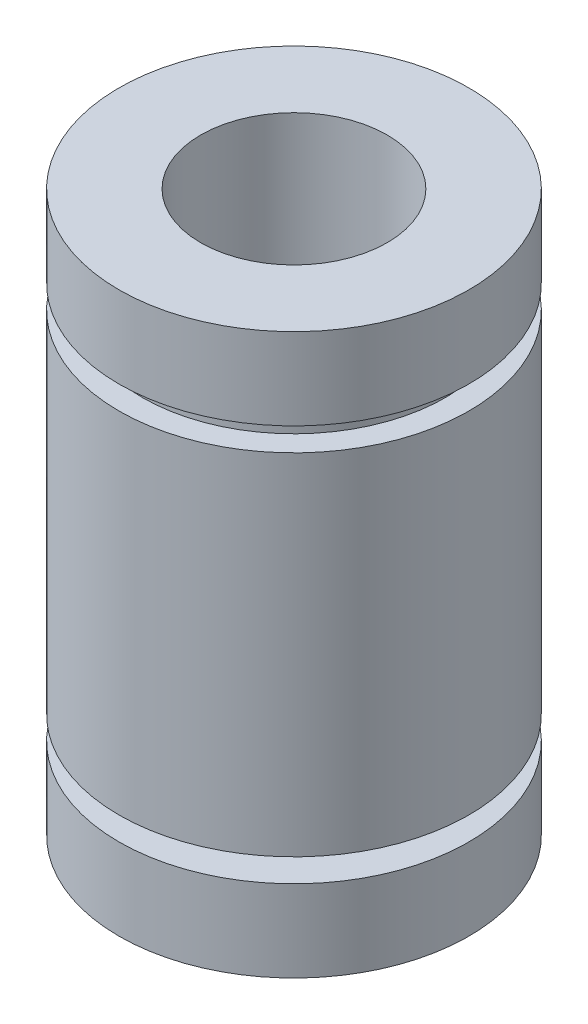
ISO-10303-21;
HEADER;
FILE_DESCRIPTION(('STEP AP214'),'2;1');
FILE_NAME('part.step','',(''),(''),'','','');
FILE_SCHEMA(('AUTOMOTIVE_DESIGN { 1 0 10303 214 1 1 1 1 }'));
ENDSEC;
DATA;
#1=APPLICATION_CONTEXT('core data for automotive mechanical design processes');
#2=APPLICATION_PROTOCOL_DEFINITION('international standard','automotive_design',2000,#1);
#3=PRODUCT_CONTEXT('',#1,'mechanical');
#4=PRODUCT('Part','Part','',(#3));
#5=PRODUCT_RELATED_PRODUCT_CATEGORY('part','',(#4));
#6=PRODUCT_DEFINITION_FORMATION('','',#4);
#7=PRODUCT_DEFINITION_CONTEXT('part definition',#1,'design');
#8=PRODUCT_DEFINITION('design','',#6,#7);
#9=PRODUCT_DEFINITION_SHAPE('','',#8);
#10=(LENGTH_UNIT() NAMED_UNIT(*) SI_UNIT(.MILLI.,.METRE.));
#11=(NAMED_UNIT(*) PLANE_ANGLE_UNIT() SI_UNIT($,.RADIAN.));
#12=(NAMED_UNIT(*) SI_UNIT($,.STERADIAN.) SOLID_ANGLE_UNIT());
#13=UNCERTAINTY_MEASURE_WITH_UNIT(LENGTH_MEASURE(1.E-05),#10,'distance_accuracy_value','');
#14=(GEOMETRIC_REPRESENTATION_CONTEXT(3) GLOBAL_UNCERTAINTY_ASSIGNED_CONTEXT((#13)) GLOBAL_UNIT_ASSIGNED_CONTEXT((#10,
#11,#12)) REPRESENTATION_CONTEXT('',''));
#15=CARTESIAN_POINT('',(0.,0.,0.));
#16=DIRECTION('',(0.,0.,1.));
#17=DIRECTION('',(1.,0.,0.));
#18=AXIS2_PLACEMENT_3D('',#15,#16,#17);
#19=CARTESIAN_POINT('',(0.,0.,0.));
#20=DIRECTION('',(0.,1.,0.));
#21=DIRECTION('',(0.,0.,1.));
#22=AXIS2_PLACEMENT_3D('',#19,#20,#21);
#23=CYLINDRICAL_SURFACE('',#22,7.5);
#24=CARTESIAN_POINT('',(0.,-3.5,0.));
#25=DIRECTION('',(0.,1.,0.));
#26=DIRECTION('',(0.,0.,1.));
#27=AXIS2_PLACEMENT_3D('',#24,#25,#26);
#28=CIRCLE('',#27,7.5);
#29=CARTESIAN_POINT('',(0.,-3.5,7.5));
#30=VERTEX_POINT('',#29);
#31=EDGE_CURVE('E10',#30,#30,#28,.T.);
#32=ORIENTED_EDGE('',*,*,#31,.T.);
#33=EDGE_LOOP('',(#32));
#34=FACE_BOUND('',#33,.T.);
#35=CARTESIAN_POINT('',(0.,0.,0.));
#36=DIRECTION('',(0.,1.,0.));
#37=DIRECTION('',(0.,0.,1.));
#38=AXIS2_PLACEMENT_3D('',#35,#36,#37);
#39=CIRCLE('',#38,7.5);
#40=CARTESIAN_POINT('',(0.,0.,7.5));
#41=VERTEX_POINT('',#40);
#42=EDGE_CURVE('E72',#41,#41,#39,.T.);
#43=ORIENTED_EDGE('',*,*,#42,.F.);
#44=EDGE_LOOP('',(#43));
#45=FACE_BOUND('',#44,.T.);
#46=ADVANCED_FACE('F32',(#34,#45),#23,.T.);
#47=CARTESIAN_POINT('',(0.,-3.5,7.5));
#48=DIRECTION('',(0.,-1.,0.));
#49=DIRECTION('',(0.,0.,-1.));
#50=AXIS2_PLACEMENT_3D('',#47,#48,#49);
#51=PLANE('',#50);
#52=CARTESIAN_POINT('',(0.,-3.5,0.));
#53=DIRECTION('',(0.,1.,0.));
#54=DIRECTION('',(0.,0.,1.));
#55=AXIS2_PLACEMENT_3D('',#52,#53,#54);
#56=CIRCLE('',#55,6.5);
#57=CARTESIAN_POINT('',(0.,-3.5,6.5));
#58=VERTEX_POINT('',#57);
#59=EDGE_CURVE('E38',#58,#58,#56,.T.);
#60=ORIENTED_EDGE('',*,*,#59,.T.);
#61=EDGE_LOOP('',(#60));
#62=FACE_BOUND('',#61,.T.);
#63=ORIENTED_EDGE('',*,*,#31,.F.);
#64=EDGE_LOOP('',(#63));
#65=FACE_BOUND('',#64,.T.);
#66=ADVANCED_FACE('F80',(#62,#65),#51,.T.);
#67=CARTESIAN_POINT('',(0.,0.,0.));
#68=DIRECTION('',(0.,1.,0.));
#69=DIRECTION('',(0.,0.,1.));
#70=AXIS2_PLACEMENT_3D('',#67,#68,#69);
#71=CYLINDRICAL_SURFACE('',#70,6.5);
#72=CARTESIAN_POINT('',(0.,-4.5,0.));
#73=DIRECTION('',(0.,1.,0.));
#74=DIRECTION('',(0.,0.,1.));
#75=AXIS2_PLACEMENT_3D('',#72,#73,#74);
#76=CIRCLE('',#75,6.5);
#77=CARTESIAN_POINT('',(0.,-4.5,6.5));
#78=VERTEX_POINT('',#77);
#79=EDGE_CURVE('E42',#78,#78,#76,.T.);
#80=ORIENTED_EDGE('',*,*,#79,.T.);
#81=EDGE_LOOP('',(#80));
#82=FACE_BOUND('',#81,.T.);
#83=ORIENTED_EDGE('',*,*,#59,.F.);
#84=EDGE_LOOP('',(#83));
#85=FACE_BOUND('',#84,.T.);
#86=ADVANCED_FACE('F84',(#82,#85),#71,.T.);
#87=CARTESIAN_POINT('',(0.,-4.5,6.5));
#88=DIRECTION('',(0.,1.,0.));
#89=DIRECTION('',(0.,0.,1.));
#90=AXIS2_PLACEMENT_3D('',#87,#88,#89);
#91=PLANE('',#90);
#92=CARTESIAN_POINT('',(0.,-4.5,0.));
#93=DIRECTION('',(0.,1.,0.));
#94=DIRECTION('',(0.,0.,1.));
#95=AXIS2_PLACEMENT_3D('',#92,#93,#94);
#96=CIRCLE('',#95,7.5);
#97=CARTESIAN_POINT('',(0.,-4.5,7.5));
#98=VERTEX_POINT('',#97);
#99=EDGE_CURVE('E46',#98,#98,#96,.T.);
#100=ORIENTED_EDGE('',*,*,#99,.T.);
#101=EDGE_LOOP('',(#100));
#102=FACE_BOUND('',#101,.T.);
#103=ORIENTED_EDGE('',*,*,#79,.F.);
#104=EDGE_LOOP('',(#103));
#105=FACE_BOUND('',#104,.T.);
#106=ADVANCED_FACE('F88',(#102,#105),#91,.T.);
#107=CARTESIAN_POINT('',(0.,0.,0.));
#108=DIRECTION('',(0.,1.,0.));
#109=DIRECTION('',(0.,0.,1.));
#110=AXIS2_PLACEMENT_3D('',#107,#108,#109);
#111=CYLINDRICAL_SURFACE('',#110,7.5);
#112=CARTESIAN_POINT('',(0.,-19.5,0.));
#113=DIRECTION('',(0.,1.,0.));
#114=DIRECTION('',(0.,0.,1.));
#115=AXIS2_PLACEMENT_3D('',#112,#113,#114);
#116=CIRCLE('',#115,7.5);
#117=CARTESIAN_POINT('',(0.,-19.5,7.5));
#118=VERTEX_POINT('',#117);
#119=EDGE_CURVE('E51',#118,#118,#116,.T.);
#120=ORIENTED_EDGE('',*,*,#119,.T.);
#121=EDGE_LOOP('',(#120));
#122=FACE_BOUND('',#121,.T.);
#123=ORIENTED_EDGE('',*,*,#99,.F.);
#124=EDGE_LOOP('',(#123));
#125=FACE_BOUND('',#124,.T.);
#126=ADVANCED_FACE('F95',(#122,#125),#111,.T.);
#127=CARTESIAN_POINT('',(0.,-19.5,7.5));
#128=DIRECTION('',(0.,-1.,0.));
#129=DIRECTION('',(0.,0.,-1.));
#130=AXIS2_PLACEMENT_3D('',#127,#128,#129);
#131=PLANE('',#130);
#132=CARTESIAN_POINT('',(0.,-19.5,0.));
#133=DIRECTION('',(0.,1.,0.));
#134=DIRECTION('',(0.,0.,1.));
#135=AXIS2_PLACEMENT_3D('',#132,#133,#134);
#136=CIRCLE('',#135,5.75);
#137=CARTESIAN_POINT('',(0.,-19.5,5.75));
#138=VERTEX_POINT('',#137);
#139=EDGE_CURVE('E54',#138,#138,#136,.T.);
#140=ORIENTED_EDGE('',*,*,#139,.T.);
#141=EDGE_LOOP('',(#140));
#142=FACE_BOUND('',#141,.T.);
#143=ORIENTED_EDGE('',*,*,#119,.F.);
#144=EDGE_LOOP('',(#143));
#145=FACE_BOUND('',#144,.T.);
#146=ADVANCED_FACE('F99',(#142,#145),#131,.T.);
#147=CARTESIAN_POINT('',(0.,0.,0.));
#148=DIRECTION('',(0.,1.,0.));
#149=DIRECTION('',(0.,0.,1.));
#150=AXIS2_PLACEMENT_3D('',#147,#148,#149);
#151=CYLINDRICAL_SURFACE('',#150,5.75);
#152=CARTESIAN_POINT('',(0.,-20.5,0.));
#153=DIRECTION('',(0.,1.,0.));
#154=DIRECTION('',(0.,0.,1.));
#155=AXIS2_PLACEMENT_3D('',#152,#153,#154);
#156=CIRCLE('',#155,5.75);
#157=CARTESIAN_POINT('',(0.,-20.5,5.75));
#158=VERTEX_POINT('',#157);
#159=EDGE_CURVE('E57',#158,#158,#156,.T.);
#160=ORIENTED_EDGE('',*,*,#159,.T.);
#161=EDGE_LOOP('',(#160));
#162=FACE_BOUND('',#161,.T.);
#163=ORIENTED_EDGE('',*,*,#139,.F.);
#164=EDGE_LOOP('',(#163));
#165=FACE_BOUND('',#164,.T.);
#166=ADVANCED_FACE('F103',(#162,#165),#151,.T.);
#167=CARTESIAN_POINT('',(0.,-20.5,5.75));
#168=DIRECTION('',(0.,1.,0.));
#169=DIRECTION('',(0.,0.,1.));
#170=AXIS2_PLACEMENT_3D('',#167,#168,#169);
#171=PLANE('',#170);
#172=CARTESIAN_POINT('',(0.,-20.5,0.));
#173=DIRECTION('',(0.,1.,0.));
#174=DIRECTION('',(0.,0.,1.));
#175=AXIS2_PLACEMENT_3D('',#172,#173,#174);
#176=CIRCLE('',#175,7.5);
#177=CARTESIAN_POINT('',(0.,-20.5,7.5));
#178=VERTEX_POINT('',#177);
#179=EDGE_CURVE('E60',#178,#178,#176,.T.);
#180=ORIENTED_EDGE('',*,*,#179,.T.);
#181=EDGE_LOOP('',(#180));
#182=FACE_BOUND('',#181,.T.);
#183=ORIENTED_EDGE('',*,*,#159,.F.);
#184=EDGE_LOOP('',(#183));
#185=FACE_BOUND('',#184,.T.);
#186=ADVANCED_FACE('F107',(#182,#185),#171,.T.);
#187=CARTESIAN_POINT('',(0.,0.,0.));
#188=DIRECTION('',(0.,1.,0.));
#189=DIRECTION('',(0.,0.,1.));
#190=AXIS2_PLACEMENT_3D('',#187,#188,#189);
#191=CYLINDRICAL_SURFACE('',#190,7.5);
#192=CARTESIAN_POINT('',(0.,-24.,0.));
#193=DIRECTION('',(0.,1.,0.));
#194=DIRECTION('',(0.,0.,1.));
#195=AXIS2_PLACEMENT_3D('',#192,#193,#194);
#196=CIRCLE('',#195,7.5);
#197=CARTESIAN_POINT('',(0.,-24.,7.5));
#198=VERTEX_POINT('',#197);
#199=EDGE_CURVE('E63',#198,#198,#196,.T.);
#200=ORIENTED_EDGE('',*,*,#199,.T.);
#201=EDGE_LOOP('',(#200));
#202=FACE_BOUND('',#201,.T.);
#203=ORIENTED_EDGE('',*,*,#179,.F.);
#204=EDGE_LOOP('',(#203));
#205=FACE_BOUND('',#204,.T.);
#206=ADVANCED_FACE('F111',(#202,#205),#191,.T.);
#207=CARTESIAN_POINT('',(0.,-24.,7.5));
#208=DIRECTION('',(0.,-1.,0.));
#209=DIRECTION('',(0.,0.,-1.));
#210=AXIS2_PLACEMENT_3D('',#207,#208,#209);
#211=PLANE('',#210);
#212=CARTESIAN_POINT('',(0.,-24.,0.));
#213=DIRECTION('',(0.,1.,0.));
#214=DIRECTION('',(0.,0.,1.));
#215=AXIS2_PLACEMENT_3D('',#212,#213,#214);
#216=CIRCLE('',#215,4.);
#217=CARTESIAN_POINT('',(0.,-24.,4.));
#218=VERTEX_POINT('',#217);
#219=EDGE_CURVE('E66',#218,#218,#216,.T.);
#220=ORIENTED_EDGE('',*,*,#219,.T.);
#221=EDGE_LOOP('',(#220));
#222=FACE_BOUND('',#221,.T.);
#223=ORIENTED_EDGE('',*,*,#199,.F.);
#224=EDGE_LOOP('',(#223));
#225=FACE_BOUND('',#224,.T.);
#226=ADVANCED_FACE('F115',(#222,#225),#211,.T.);
#227=CARTESIAN_POINT('',(0.,0.,0.));
#228=DIRECTION('',(0.,1.,0.));
#229=DIRECTION('',(0.,0.,1.));
#230=AXIS2_PLACEMENT_3D('',#227,#228,#229);
#231=CYLINDRICAL_SURFACE('',#230,4.);
#232=CARTESIAN_POINT('',(0.,0.,0.));
#233=DIRECTION('',(0.,1.,0.));
#234=DIRECTION('',(0.,0.,1.));
#235=AXIS2_PLACEMENT_3D('',#232,#233,#234);
#236=CIRCLE('',#235,4.);
#237=CARTESIAN_POINT('',(0.,0.,4.));
#238=VERTEX_POINT('',#237);
#239=EDGE_CURVE('E69',#238,#238,#236,.T.);
#240=ORIENTED_EDGE('',*,*,#239,.T.);
#241=EDGE_LOOP('',(#240));
#242=FACE_BOUND('',#241,.T.);
#243=ORIENTED_EDGE('',*,*,#219,.F.);
#244=EDGE_LOOP('',(#243));
#245=FACE_BOUND('',#244,.T.);
#246=ADVANCED_FACE('F119',(#242,#245),#231,.F.);
#247=CARTESIAN_POINT('',(0.,0.,7.5));
#248=DIRECTION('',(0.,1.,0.));
#249=DIRECTION('',(0.,0.,1.));
#250=AXIS2_PLACEMENT_3D('',#247,#248,#249);
#251=PLANE('',#250);
#252=ORIENTED_EDGE('',*,*,#42,.T.);
#253=EDGE_LOOP('',(#252));
#254=FACE_BOUND('',#253,.T.);
#255=ORIENTED_EDGE('',*,*,#239,.F.);
#256=EDGE_LOOP('',(#255));
#257=FACE_BOUND('',#256,.T.);
#258=ADVANCED_FACE('F76',(#254,#257),#251,.T.);
#259=CLOSED_SHELL('',(#46,#66,#86,#106,#126,#146,#166,#186,#206,#226,#246,#258));
#260=MANIFOLD_SOLID_BREP('B2',#259);
#261=ADVANCED_BREP_SHAPE_REPRESENTATION('',(#18,#260),#14);
#262=SHAPE_DEFINITION_REPRESENTATION(#9,#261);
ENDSEC;
END-ISO-10303-21;
